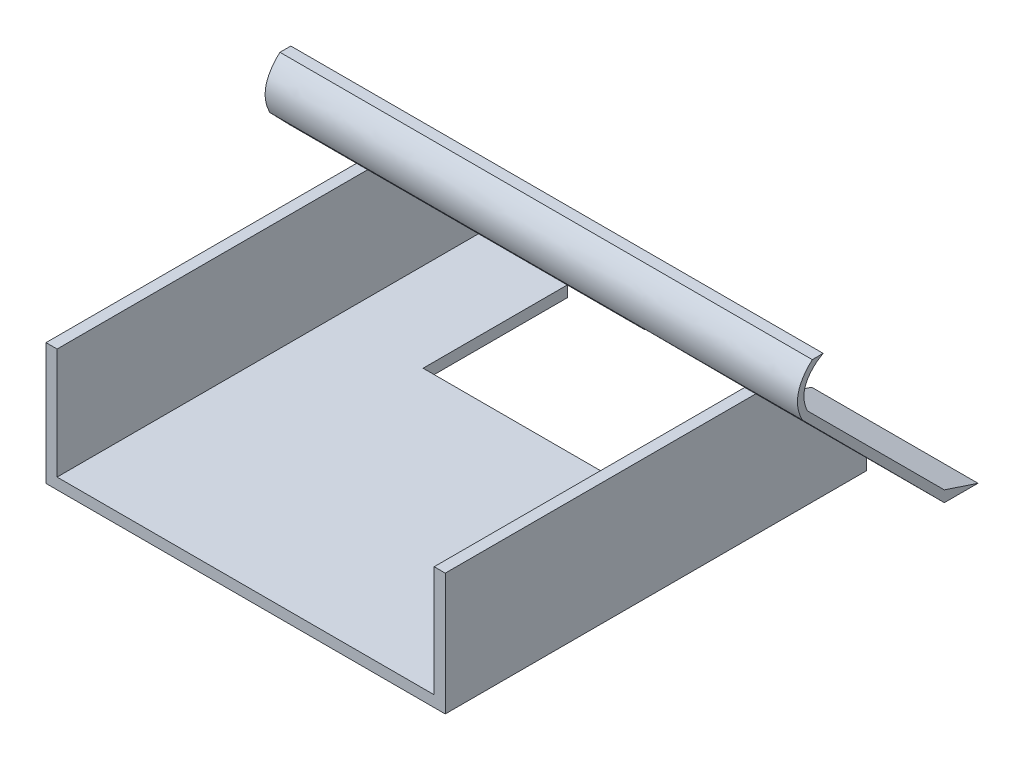
ISO-10303-21;
HEADER;
FILE_DESCRIPTION(('STEP AP214'),'2;1');
FILE_NAME('part.step','',(''),(''),'','','');
FILE_SCHEMA(('AUTOMOTIVE_DESIGN { 1 0 10303 214 1 1 1 1 }'));
ENDSEC;
DATA;
#1=APPLICATION_CONTEXT('core data for automotive mechanical design processes');
#2=APPLICATION_PROTOCOL_DEFINITION('international standard','automotive_design',2000,#1);
#3=PRODUCT_CONTEXT('',#1,'mechanical');
#4=PRODUCT('Part','Part','',(#3));
#5=PRODUCT_RELATED_PRODUCT_CATEGORY('part','',(#4));
#6=PRODUCT_DEFINITION_FORMATION('','',#4);
#7=PRODUCT_DEFINITION_CONTEXT('part definition',#1,'design');
#8=PRODUCT_DEFINITION('design','',#6,#7);
#9=PRODUCT_DEFINITION_SHAPE('','',#8);
#10=(LENGTH_UNIT() NAMED_UNIT(*) SI_UNIT(.MILLI.,.METRE.));
#11=(NAMED_UNIT(*) PLANE_ANGLE_UNIT() SI_UNIT($,.RADIAN.));
#12=(NAMED_UNIT(*) SI_UNIT($,.STERADIAN.) SOLID_ANGLE_UNIT());
#13=UNCERTAINTY_MEASURE_WITH_UNIT(LENGTH_MEASURE(1.E-05),#10,'distance_accuracy_value','');
#14=(GEOMETRIC_REPRESENTATION_CONTEXT(3) GLOBAL_UNCERTAINTY_ASSIGNED_CONTEXT((#13)) GLOBAL_UNIT_ASSIGNED_CONTEXT((#10,
#11,#12)) REPRESENTATION_CONTEXT('',''));
#15=CARTESIAN_POINT('',(0.,0.,0.));
#16=DIRECTION('',(0.,0.,1.));
#17=DIRECTION('',(1.,0.,0.));
#18=AXIS2_PLACEMENT_3D('',#15,#16,#17);
#19=CARTESIAN_POINT('',(45.,0.,0.));
#20=DIRECTION('',(-1.,0.,0.));
#21=DIRECTION('',(0.,0.,1.));
#22=AXIS2_PLACEMENT_3D('',#19,#20,#21);
#23=PLANE('',#22);
#24=DIRECTION('',(0.,-0.708681800429016,-0.705528245884379));
#25=VECTOR('',#24,1.);
#26=CARTESIAN_POINT('',(45.,0.,-100.));
#27=LINE('',#26,#25);
#28=CARTESIAN_POINT('',(45.,64.353430525771,-35.9329350238658));
#29=VERTEX_POINT('',#28);
#30=CARTESIAN_POINT('',(45.,60.,-40.2669932719644));
#31=VERTEX_POINT('',#30);
#32=EDGE_CURVE('E286',#29,#31,#27,.T.);
#33=ORIENTED_EDGE('',*,*,#32,.F.);
#34=DIRECTION('',(0.,-0.730731737442361,-0.682664725831406));
#35=VECTOR('',#34,1.);
#36=CARTESIAN_POINT('',(45.,60.,-40.));
#37=LINE('',#36,#35);
#38=CARTESIAN_POINT('',(45.,60.,-40.));
#39=VERTEX_POINT('',#38);
#40=EDGE_CURVE('E296',#29,#39,#37,.T.);
#41=ORIENTED_EDGE('',*,*,#40,.T.);
#42=DIRECTION('',(0.,0.,-1.));
#43=VECTOR('',#42,1.);
#44=CARTESIAN_POINT('',(45.,60.,-45.0000000000002));
#45=LINE('',#44,#43);
#46=EDGE_CURVE('E311',#39,#31,#45,.T.);
#47=ORIENTED_EDGE('',*,*,#46,.T.);
#48=EDGE_LOOP('',(#33,#41,#47));
#49=FACE_BOUND('',#48,.T.);
#50=ADVANCED_FACE('F43',(#49),#23,.F.);
#51=CARTESIAN_POINT('',(-45.,0.,0.));
#52=DIRECTION('',(-1.,0.,0.));
#53=DIRECTION('',(0.,0.,1.));
#54=AXIS2_PLACEMENT_3D('',#51,#52,#53);
#55=PLANE('',#54);
#56=DIRECTION('',(0.,0.,-1.));
#57=VECTOR('',#56,1.);
#58=CARTESIAN_POINT('',(-45.,60.,-45.0000000000002));
#59=LINE('',#58,#57);
#60=CARTESIAN_POINT('',(-45.,60.,-40.153080492151));
#61=VERTEX_POINT('',#60);
#62=CARTESIAN_POINT('',(-45.,60.,-45.0000000000002));
#63=VERTEX_POINT('',#62);
#64=EDGE_CURVE('E12',#61,#63,#59,.T.);
#65=ORIENTED_EDGE('',*,*,#64,.F.);
#66=DIRECTION('',(0.,0.718012724361384,0.69602997611823));
#67=VECTOR('',#66,1.);
#68=CARTESIAN_POINT('',(-45.,64.353430525771,-35.9329350238658));
#69=LINE('',#68,#67);
#70=CARTESIAN_POINT('',(-45.,55.,-45.0000000000002));
#71=VERTEX_POINT('',#70);
#72=EDGE_CURVE('E321',#71,#61,#69,.T.);
#73=ORIENTED_EDGE('',*,*,#72,.F.);
#74=DIRECTION('',(0.,0.707106781186549,0.707106781186546));
#75=VECTOR('',#74,1.);
#76=CARTESIAN_POINT('',(-45.,55.,-45.0000000000002));
#77=LINE('',#76,#75);
#78=CARTESIAN_POINT('',(-45.,0.,-100.));
#79=VERTEX_POINT('',#78);
#80=EDGE_CURVE('E388',#79,#71,#77,.T.);
#81=ORIENTED_EDGE('',*,*,#80,.F.);
#82=DIRECTION('',(0.,0.,1.));
#83=VECTOR('',#82,1.);
#84=CARTESIAN_POINT('',(-45.,0.,-100.));
#85=LINE('',#84,#83);
#86=CARTESIAN_POINT('',(-45.,0.,-115.179593987314));
#87=VERTEX_POINT('',#86);
#88=EDGE_CURVE('E408',#87,#79,#85,.T.);
#89=ORIENTED_EDGE('',*,*,#88,.F.);
#90=DIRECTION('',(0.,-0.31285456148725,-0.94980104409114));
#91=VECTOR('',#90,1.);
#92=CARTESIAN_POINT('',(-45.,0.,-115.179593987314));
#93=LINE('',#92,#91);
#94=CARTESIAN_POINT('',(-45.,5.,-100.));
#95=VERTEX_POINT('',#94);
#96=EDGE_CURVE('E410',#95,#87,#93,.T.);
#97=ORIENTED_EDGE('',*,*,#96,.F.);
#98=DIRECTION('',(0.,-0.707106781186549,-0.707106781186546));
#99=VECTOR('',#98,1.);
#100=CARTESIAN_POINT('',(-45.,5.,-100.));
#101=LINE('',#100,#99);
#102=EDGE_CURVE('E324',#63,#95,#101,.T.);
#103=ORIENTED_EDGE('',*,*,#102,.F.);
#104=EDGE_LOOP('',(#65,#73,#81,#89,#97,#103));
#105=FACE_BOUND('',#104,.T.);
#106=ADVANCED_FACE('F224',(#105),#55,.F.);
#107=CARTESIAN_POINT('',(-120.,64.353430525771,-35.9329350238658));
#108=DIRECTION('',(0.,0.69602997611823,-0.718012724361384));
#109=DIRECTION('',(0.,0.718012724361384,0.69602997611823));
#110=AXIS2_PLACEMENT_3D('',#107,#108,#109);
#111=PLANE('',#110);
#112=DIRECTION('',(1.,0.,0.));
#113=VECTOR('',#112,1.);
#114=CARTESIAN_POINT('',(-120.,55.,-45.0000000000002));
#115=LINE('',#114,#113);
#116=CARTESIAN_POINT('',(-120.,55.,-45.0000000000002));
#117=VERTEX_POINT('',#116);
#118=EDGE_CURVE('E398',#117,#71,#115,.T.);
#119=ORIENTED_EDGE('',*,*,#118,.T.);
#120=ORIENTED_EDGE('',*,*,#72,.T.);
#121=CARTESIAN_POINT('',(-45.,64.353430525771,-35.9329350238658));
#122=VERTEX_POINT('',#121);
#123=EDGE_CURVE('E325',#61,#122,#69,.T.);
#124=ORIENTED_EDGE('',*,*,#123,.T.);
#125=DIRECTION('',(1.,0.,0.));
#126=VECTOR('',#125,1.);
#127=CARTESIAN_POINT('',(-120.,64.353430525771,-35.9329350238658));
#128=LINE('',#127,#126);
#129=CARTESIAN_POINT('',(-120.,64.353430525771,-35.9329350238658));
#130=VERTEX_POINT('',#129);
#131=EDGE_CURVE('E52',#130,#122,#128,.T.);
#132=ORIENTED_EDGE('',*,*,#131,.F.);
#133=DIRECTION('',(0.,0.718012724361384,0.69602997611823));
#134=VECTOR('',#133,1.);
#135=CARTESIAN_POINT('',(-120.,64.353430525771,-35.9329350238658));
#136=LINE('',#135,#134);
#137=EDGE_CURVE('E387',#117,#130,#136,.T.);
#138=ORIENTED_EDGE('',*,*,#137,.F.);
#139=EDGE_LOOP('',(#119,#120,#124,#132,#138));
#140=FACE_BOUND('',#139,.T.);
#141=ADVANCED_FACE('F45',(#140),#111,.F.);
#142=CARTESIAN_POINT('',(-120.,5.,-100.));
#143=DIRECTION('',(0.,-0.707106781186546,0.707106781186549));
#144=DIRECTION('',(0.,-0.707106781186549,-0.707106781186546));
#145=AXIS2_PLACEMENT_3D('',#142,#143,#144);
#146=PLANE('',#145);
#147=DIRECTION('',(1.,0.,0.));
#148=VECTOR('',#147,1.);
#149=CARTESIAN_POINT('',(-120.,66.7102477509527,-38.2897522490475));
#150=LINE('',#149,#148);
#151=CARTESIAN_POINT('',(-120.,66.7102477509527,-38.2897522490475));
#152=VERTEX_POINT('',#151);
#153=CARTESIAN_POINT('',(120.,66.7102477509527,-38.2897522490475));
#154=VERTEX_POINT('',#153);
#155=EDGE_CURVE('E263',#152,#154,#150,.T.);
#156=ORIENTED_EDGE('',*,*,#155,.T.);
#157=DIRECTION('',(0.,0.707106781186549,0.707106781186546));
#158=VECTOR('',#157,1.);
#159=CARTESIAN_POINT('',(120.,66.7102477509527,-38.2897522490475));
#160=LINE('',#159,#158);
#161=CARTESIAN_POINT('',(120.,5.,-100.));
#162=VERTEX_POINT('',#161);
#163=EDGE_CURVE('E265',#162,#154,#160,.T.);
#164=ORIENTED_EDGE('',*,*,#163,.F.);
#165=DIRECTION('',(-1.,0.,0.));
#166=VECTOR('',#165,1.);
#167=CARTESIAN_POINT('',(120.,5.,-100.));
#168=LINE('',#167,#166);
#169=CARTESIAN_POINT('',(45.,5.,-100.));
#170=VERTEX_POINT('',#169);
#171=EDGE_CURVE('E275',#162,#170,#168,.T.);
#172=ORIENTED_EDGE('',*,*,#171,.T.);
#173=DIRECTION('',(0.,0.707106781186549,0.707106781186546));
#174=VECTOR('',#173,1.);
#175=CARTESIAN_POINT('',(45.,66.7102477509527,-38.2897522490475));
#176=LINE('',#175,#174);
#177=CARTESIAN_POINT('',(45.,60.,-45.0000000000002));
#178=VERTEX_POINT('',#177);
#179=EDGE_CURVE('E349',#170,#178,#176,.T.);
#180=ORIENTED_EDGE('',*,*,#179,.T.);
#181=DIRECTION('',(-1.,0.,0.));
#182=VECTOR('',#181,1.);
#183=CARTESIAN_POINT('',(45.,60.,-45.0000000000002));
#184=LINE('',#183,#182);
#185=EDGE_CURVE('E312',#178,#63,#184,.T.);
#186=ORIENTED_EDGE('',*,*,#185,.T.);
#187=ORIENTED_EDGE('',*,*,#102,.T.);
#188=DIRECTION('',(1.,0.,0.));
#189=VECTOR('',#188,1.);
#190=CARTESIAN_POINT('',(-120.,5.,-100.));
#191=LINE('',#190,#189);
#192=CARTESIAN_POINT('',(-120.,5.,-100.));
#193=VERTEX_POINT('',#192);
#194=EDGE_CURVE('E270',#193,#95,#191,.T.);
#195=ORIENTED_EDGE('',*,*,#194,.F.);
#196=DIRECTION('',(0.,-0.707106781186549,-0.707106781186546));
#197=VECTOR('',#196,1.);
#198=CARTESIAN_POINT('',(-120.,5.,-100.));
#199=LINE('',#198,#197);
#200=EDGE_CURVE('E267',#152,#193,#199,.T.);
#201=ORIENTED_EDGE('',*,*,#200,.F.);
#202=EDGE_LOOP('',(#156,#164,#172,#180,#186,#187,#195,#201));
#203=FACE_BOUND('',#202,.T.);
#204=ADVANCED_FACE('F252',(#203),#146,.F.);
#205=CARTESIAN_POINT('',(-120.,0.,-115.179593987314));
#206=DIRECTION('',(0.,-0.94980104409114,0.31285456148725));
#207=DIRECTION('',(0.,-0.31285456148725,-0.94980104409114));
#208=AXIS2_PLACEMENT_3D('',#205,#206,#207);
#209=PLANE('',#208);
#210=ORIENTED_EDGE('',*,*,#194,.T.);
#211=ORIENTED_EDGE('',*,*,#96,.T.);
#212=DIRECTION('',(1.,0.,0.));
#213=VECTOR('',#212,1.);
#214=CARTESIAN_POINT('',(-120.,0.,-115.179593987314));
#215=LINE('',#214,#213);
#216=CARTESIAN_POINT('',(-120.,0.,-115.179593987314));
#217=VERTEX_POINT('',#216);
#218=EDGE_CURVE('E394',#217,#87,#215,.T.);
#219=ORIENTED_EDGE('',*,*,#218,.F.);
#220=DIRECTION('',(0.,-0.31285456148725,-0.94980104409114));
#221=VECTOR('',#220,1.);
#222=CARTESIAN_POINT('',(-120.,0.,-115.179593987314));
#223=LINE('',#222,#221);
#224=EDGE_CURVE('E403',#193,#217,#223,.T.);
#225=ORIENTED_EDGE('',*,*,#224,.F.);
#226=EDGE_LOOP('',(#210,#211,#219,#225));
#227=FACE_BOUND('',#226,.T.);
#228=ADVANCED_FACE('F249',(#227),#209,.F.);
#229=CARTESIAN_POINT('',(-120.,0.,-100.));
#230=DIRECTION('',(0.,1.,0.));
#231=DIRECTION('',(0.,0.,1.));
#232=AXIS2_PLACEMENT_3D('',#229,#230,#231);
#233=PLANE('',#232);
#234=ORIENTED_EDGE('',*,*,#218,.T.);
#235=ORIENTED_EDGE('',*,*,#88,.T.);
#236=DIRECTION('',(1.,0.,0.));
#237=VECTOR('',#236,1.);
#238=CARTESIAN_POINT('',(-120.,0.,-100.));
#239=LINE('',#238,#237);
#240=CARTESIAN_POINT('',(-120.,0.,-100.));
#241=VERTEX_POINT('',#240);
#242=EDGE_CURVE('E396',#241,#79,#239,.T.);
#243=ORIENTED_EDGE('',*,*,#242,.F.);
#244=DIRECTION('',(0.,0.,1.));
#245=VECTOR('',#244,1.);
#246=CARTESIAN_POINT('',(-120.,0.,-100.));
#247=LINE('',#246,#245);
#248=EDGE_CURVE('E401',#217,#241,#247,.T.);
#249=ORIENTED_EDGE('',*,*,#248,.F.);
#250=EDGE_LOOP('',(#234,#235,#243,#249));
#251=FACE_BOUND('',#250,.T.);
#252=ADVANCED_FACE('F245',(#251),#233,.F.);
#253=CARTESIAN_POINT('',(-120.,55.,-45.0000000000002));
#254=DIRECTION('',(0.,0.707106781186546,-0.707106781186549));
#255=DIRECTION('',(0.,0.707106781186549,0.707106781186546));
#256=AXIS2_PLACEMENT_3D('',#253,#254,#255);
#257=PLANE('',#256);
#258=ORIENTED_EDGE('',*,*,#242,.T.);
#259=ORIENTED_EDGE('',*,*,#80,.T.);
#260=ORIENTED_EDGE('',*,*,#118,.F.);
#261=DIRECTION('',(0.,0.707106781186549,0.707106781186546));
#262=VECTOR('',#261,1.);
#263=CARTESIAN_POINT('',(-120.,55.,-45.0000000000002));
#264=LINE('',#263,#262);
#265=EDGE_CURVE('E67',#241,#117,#264,.T.);
#266=ORIENTED_EDGE('',*,*,#265,.F.);
#267=EDGE_LOOP('',(#258,#259,#260,#266));
#268=FACE_BOUND('',#267,.T.);
#269=ADVANCED_FACE('F242',(#268),#257,.F.);
#270=CARTESIAN_POINT('',(-120.,0.,0.));
#271=DIRECTION('',(-1.,0.,0.));
#272=DIRECTION('',(0.,0.,1.));
#273=AXIS2_PLACEMENT_3D('',#270,#271,#272);
#274=PLANE('',#273);
#275=ORIENTED_EDGE('',*,*,#137,.T.);
#276=CARTESIAN_POINT('',(-120.,64.353430525771,-35.9329350238658));
#277=CARTESIAN_POINT('',(-120.,76.0268249741707,-29.9996183368631));
#278=CARTESIAN_POINT('',(-120.,85.6244735808665,-40.4707945091157));
#279=B_SPLINE_CURVE_WITH_KNOTS('',2,(#276,#277,#278),.UNSPECIFIED.,.F.,.F.,(3,3),(0.,1.),.UNSPECIFIED.);
#280=CARTESIAN_POINT('',(-120.,85.6244735808665,-40.4707945091157));
#281=VERTEX_POINT('',#280);
#282=EDGE_CURVE('E364',#130,#281,#279,.T.);
#283=ORIENTED_EDGE('',*,*,#282,.T.);
#284=DIRECTION('',(0.,0.,-1.));
#285=VECTOR('',#284,1.);
#286=CARTESIAN_POINT('',(-120.,85.6244735808665,-40.4707945091157));
#287=LINE('',#286,#285);
#288=CARTESIAN_POINT('',(-120.,85.6244735808665,-45.3688095403349));
#289=VERTEX_POINT('',#288);
#290=EDGE_CURVE('E164',#281,#289,#287,.T.);
#291=ORIENTED_EDGE('',*,*,#290,.T.);
#292=DIRECTION('',(0.,-0.536875492193158,0.843661487732109));
#293=VECTOR('',#292,1.);
#294=CARTESIAN_POINT('',(-120.,85.6244735808665,-45.3688095403349));
#295=LINE('',#294,#293);
#296=CARTESIAN_POINT('',(-120.,83.851054345425,-42.5820078846412));
#297=VERTEX_POINT('',#296);
#298=EDGE_CURVE('E188',#289,#297,#295,.T.);
#299=ORIENTED_EDGE('',*,*,#298,.T.);
#300=CARTESIAN_POINT('',(-120.,83.851054345425,-42.5820078846412));
#301=CARTESIAN_POINT('',(-120.,76.5046634323354,-33.6123210873994));
#302=CARTESIAN_POINT('',(-120.,66.7102477509527,-38.2897522490475));
#303=B_SPLINE_CURVE_WITH_KNOTS('',2,(#300,#301,#302),.UNSPECIFIED.,.F.,.F.,(3,3),(0.,1.),.UNSPECIFIED.);
#304=EDGE_CURVE('E185',#297,#152,#303,.T.);
#305=ORIENTED_EDGE('',*,*,#304,.T.);
#306=ORIENTED_EDGE('',*,*,#200,.T.);
#307=ORIENTED_EDGE('',*,*,#224,.T.);
#308=ORIENTED_EDGE('',*,*,#248,.T.);
#309=ORIENTED_EDGE('',*,*,#265,.T.);
#310=EDGE_LOOP('',(#275,#283,#291,#299,#305,#306,#307,#308,#309));
#311=FACE_BOUND('',#310,.T.);
#312=ADVANCED_FACE('F230',(#311),#274,.T.);
#313=CARTESIAN_POINT('',(-45.,0.,0.));
#314=DIRECTION('',(-1.,0.,0.));
#315=DIRECTION('',(0.,0.,1.));
#316=AXIS2_PLACEMENT_3D('',#313,#314,#315);
#317=PLANE('',#316);
#318=ORIENTED_EDGE('',*,*,#123,.F.);
#319=CARTESIAN_POINT('',(-45.,60.,-40.));
#320=VERTEX_POINT('',#319);
#321=EDGE_CURVE('E54',#320,#61,#59,.T.);
#322=ORIENTED_EDGE('',*,*,#321,.F.);
#323=DIRECTION('',(0.,-0.730731737442361,-0.682664725831406));
#324=VECTOR('',#323,1.);
#325=CARTESIAN_POINT('',(-45.,60.,-40.));
#326=LINE('',#325,#324);
#327=EDGE_CURVE('E300',#122,#320,#326,.T.);
#328=ORIENTED_EDGE('',*,*,#327,.F.);
#329=EDGE_LOOP('',(#318,#322,#328));
#330=FACE_BOUND('',#329,.T.);
#331=ADVANCED_FACE('F226',(#330),#317,.T.);
#332=CARTESIAN_POINT('',(45.,60.,-40.));
#333=DIRECTION('',(0.,0.682664725831406,-0.730731737442361));
#334=DIRECTION('',(0.,0.730731737442361,0.682664725831406));
#335=AXIS2_PLACEMENT_3D('',#332,#333,#334);
#336=PLANE('',#335);
#337=ORIENTED_EDGE('',*,*,#327,.T.);
#338=DIRECTION('',(-1.,0.,0.));
#339=VECTOR('',#338,1.);
#340=CARTESIAN_POINT('',(45.,60.,-40.));
#341=LINE('',#340,#339);
#342=EDGE_CURVE('E317',#39,#320,#341,.T.);
#343=ORIENTED_EDGE('',*,*,#342,.F.);
#344=ORIENTED_EDGE('',*,*,#40,.F.);
#345=DIRECTION('',(-1.,0.,0.));
#346=VECTOR('',#345,1.);
#347=CARTESIAN_POINT('',(45.,64.353430525771,-35.9329350238658));
#348=LINE('',#347,#346);
#349=EDGE_CURVE('E320',#29,#122,#348,.T.);
#350=ORIENTED_EDGE('',*,*,#349,.T.);
#351=EDGE_LOOP('',(#337,#343,#344,#350));
#352=FACE_BOUND('',#351,.T.);
#353=ADVANCED_FACE('F229',(#352),#336,.F.);
#354=CARTESIAN_POINT('',(45.,60.,-45.0000000000002));
#355=DIRECTION('',(0.,1.,0.));
#356=DIRECTION('',(0.,0.,1.));
#357=AXIS2_PLACEMENT_3D('',#354,#355,#356);
#358=PLANE('',#357);
#359=ORIENTED_EDGE('',*,*,#321,.T.);
#360=ORIENTED_EDGE('',*,*,#64,.T.);
#361=ORIENTED_EDGE('',*,*,#185,.F.);
#362=EDGE_CURVE('E298',#31,#178,#45,.T.);
#363=ORIENTED_EDGE('',*,*,#362,.F.);
#364=ORIENTED_EDGE('',*,*,#46,.F.);
#365=ORIENTED_EDGE('',*,*,#342,.T.);
#366=EDGE_LOOP('',(#359,#360,#361,#363,#364,#365));
#367=FACE_BOUND('',#366,.T.);
#368=ADVANCED_FACE('F220',(#367),#358,.F.);
#369=CARTESIAN_POINT('',(120.,0.,-100.));
#370=DIRECTION('',(0.,0.705528245884379,-0.708681800429016));
#371=DIRECTION('',(0.,0.708681800429016,0.705528245884379));
#372=AXIS2_PLACEMENT_3D('',#369,#370,#371);
#373=PLANE('',#372);
#374=ORIENTED_EDGE('',*,*,#32,.T.);
#375=CARTESIAN_POINT('',(45.,0.,-100.));
#376=VERTEX_POINT('',#375);
#377=EDGE_CURVE('E283',#31,#376,#27,.T.);
#378=ORIENTED_EDGE('',*,*,#377,.T.);
#379=DIRECTION('',(-1.,0.,0.));
#380=VECTOR('',#379,1.);
#381=CARTESIAN_POINT('',(120.,0.,-100.));
#382=LINE('',#381,#380);
#383=CARTESIAN_POINT('',(120.,0.,-100.));
#384=VERTEX_POINT('',#383);
#385=EDGE_CURVE('E301',#384,#376,#382,.T.);
#386=ORIENTED_EDGE('',*,*,#385,.F.);
#387=DIRECTION('',(0.,-0.708681800429016,-0.705528245884379));
#388=VECTOR('',#387,1.);
#389=CARTESIAN_POINT('',(120.,0.,-100.));
#390=LINE('',#389,#388);
#391=CARTESIAN_POINT('',(120.,64.353430525771,-35.9329350238658));
#392=VERTEX_POINT('',#391);
#393=EDGE_CURVE('E350',#392,#384,#390,.T.);
#394=ORIENTED_EDGE('',*,*,#393,.F.);
#395=DIRECTION('',(-1.,0.,0.));
#396=VECTOR('',#395,1.);
#397=CARTESIAN_POINT('',(120.,64.353430525771,-35.9329350238658));
#398=LINE('',#397,#396);
#399=EDGE_CURVE('E183',#392,#29,#398,.T.);
#400=ORIENTED_EDGE('',*,*,#399,.T.);
#401=EDGE_LOOP('',(#374,#378,#386,#394,#400));
#402=FACE_BOUND('',#401,.T.);
#403=ADVANCED_FACE('F216',(#402),#373,.F.);
#404=CARTESIAN_POINT('',(120.,0.,-115.179593987314));
#405=DIRECTION('',(0.,1.,0.));
#406=DIRECTION('',(0.,0.,1.));
#407=AXIS2_PLACEMENT_3D('',#404,#405,#406);
#408=PLANE('',#407);
#409=DIRECTION('',(0.,0.,-1.));
#410=VECTOR('',#409,1.);
#411=CARTESIAN_POINT('',(45.,0.,-115.179593987314));
#412=LINE('',#411,#410);
#413=CARTESIAN_POINT('',(45.,0.,-115.179593987314));
#414=VERTEX_POINT('',#413);
#415=EDGE_CURVE('E288',#376,#414,#412,.T.);
#416=ORIENTED_EDGE('',*,*,#415,.T.);
#417=DIRECTION('',(-1.,0.,0.));
#418=VECTOR('',#417,1.);
#419=CARTESIAN_POINT('',(120.,0.,-115.179593987314));
#420=LINE('',#419,#418);
#421=CARTESIAN_POINT('',(120.,0.,-115.179593987314));
#422=VERTEX_POINT('',#421);
#423=EDGE_CURVE('E277',#422,#414,#420,.T.);
#424=ORIENTED_EDGE('',*,*,#423,.F.);
#425=DIRECTION('',(0.,0.,-1.));
#426=VECTOR('',#425,1.);
#427=CARTESIAN_POINT('',(120.,0.,-115.179593987314));
#428=LINE('',#427,#426);
#429=EDGE_CURVE('E279',#384,#422,#428,.T.);
#430=ORIENTED_EDGE('',*,*,#429,.F.);
#431=ORIENTED_EDGE('',*,*,#385,.T.);
#432=EDGE_LOOP('',(#416,#424,#430,#431));
#433=FACE_BOUND('',#432,.T.);
#434=ADVANCED_FACE('F212',(#433),#408,.F.);
#435=CARTESIAN_POINT('',(120.,5.,-100.));
#436=DIRECTION('',(0.,-0.94980104409114,0.31285456148725));
#437=DIRECTION('',(0.,-0.31285456148725,-0.949801044091141));
#438=AXIS2_PLACEMENT_3D('',#435,#436,#437);
#439=PLANE('',#438);
#440=DIRECTION('',(0.,0.31285456148725,0.94980104409114));
#441=VECTOR('',#440,1.);
#442=CARTESIAN_POINT('',(45.,5.,-100.));
#443=LINE('',#442,#441);
#444=EDGE_CURVE('E347',#414,#170,#443,.T.);
#445=ORIENTED_EDGE('',*,*,#444,.T.);
#446=ORIENTED_EDGE('',*,*,#171,.F.);
#447=DIRECTION('',(0.,0.31285456148725,0.94980104409114));
#448=VECTOR('',#447,1.);
#449=CARTESIAN_POINT('',(120.,5.,-100.));
#450=LINE('',#449,#448);
#451=EDGE_CURVE('E273',#422,#162,#450,.T.);
#452=ORIENTED_EDGE('',*,*,#451,.F.);
#453=ORIENTED_EDGE('',*,*,#423,.T.);
#454=EDGE_LOOP('',(#445,#446,#452,#453));
#455=FACE_BOUND('',#454,.T.);
#456=ADVANCED_FACE('F206',(#455),#439,.F.);
#457=CARTESIAN_POINT('',(120.,0.,0.));
#458=DIRECTION('',(-1.,0.,0.));
#459=DIRECTION('',(0.,0.,1.));
#460=AXIS2_PLACEMENT_3D('',#457,#458,#459);
#461=PLANE('',#460);
#462=ORIENTED_EDGE('',*,*,#163,.T.);
#463=CARTESIAN_POINT('',(120.,83.851054345425,-42.5820078846412));
#464=CARTESIAN_POINT('',(120.,76.5046634323354,-33.6123210873994));
#465=CARTESIAN_POINT('',(120.,66.7102477509527,-38.2897522490475));
#466=B_SPLINE_CURVE_WITH_KNOTS('',2,(#463,#464,#465),.UNSPECIFIED.,.F.,.F.,(3,3),(0.,1.),.UNSPECIFIED.);
#467=CARTESIAN_POINT('',(120.,83.851054345425,-42.5820078846412));
#468=VERTEX_POINT('',#467);
#469=EDGE_CURVE('E169',#468,#154,#466,.T.);
#470=ORIENTED_EDGE('',*,*,#469,.F.);
#471=DIRECTION('',(0.,-0.536875492193158,0.843661487732109));
#472=VECTOR('',#471,1.);
#473=CARTESIAN_POINT('',(120.,85.6244735808665,-45.3688095403349));
#474=LINE('',#473,#472);
#475=CARTESIAN_POINT('',(120.,85.6244735808665,-45.3688095403349));
#476=VERTEX_POINT('',#475);
#477=EDGE_CURVE('E179',#476,#468,#474,.T.);
#478=ORIENTED_EDGE('',*,*,#477,.F.);
#479=DIRECTION('',(0.,0.,-1.));
#480=VECTOR('',#479,1.);
#481=CARTESIAN_POINT('',(120.,85.6244735808665,-40.4707945091157));
#482=LINE('',#481,#480);
#483=CARTESIAN_POINT('',(120.,85.6244735808665,-40.4707945091157));
#484=VERTEX_POINT('',#483);
#485=EDGE_CURVE('E162',#484,#476,#482,.T.);
#486=ORIENTED_EDGE('',*,*,#485,.F.);
#487=CARTESIAN_POINT('',(120.,64.353430525771,-35.9329350238658));
#488=CARTESIAN_POINT('',(120.,76.0268249741707,-29.9996183368631));
#489=CARTESIAN_POINT('',(120.,85.6244735808665,-40.4707945091157));
#490=B_SPLINE_CURVE_WITH_KNOTS('',2,(#487,#488,#489),.UNSPECIFIED.,.F.,.F.,(3,3),(0.,1.),.UNSPECIFIED.);
#491=EDGE_CURVE('E175',#392,#484,#490,.T.);
#492=ORIENTED_EDGE('',*,*,#491,.F.);
#493=ORIENTED_EDGE('',*,*,#393,.T.);
#494=ORIENTED_EDGE('',*,*,#429,.T.);
#495=ORIENTED_EDGE('',*,*,#451,.T.);
#496=EDGE_LOOP('',(#462,#470,#478,#486,#492,#493,#494,#495));
#497=FACE_BOUND('',#496,.T.);
#498=ADVANCED_FACE('F174',(#497),#461,.F.);
#499=CARTESIAN_POINT('',(45.,0.,0.));
#500=DIRECTION('',(-1.,0.,0.));
#501=DIRECTION('',(0.,0.,1.));
#502=AXIS2_PLACEMENT_3D('',#499,#500,#501);
#503=PLANE('',#502);
#504=ORIENTED_EDGE('',*,*,#377,.F.);
#505=ORIENTED_EDGE('',*,*,#362,.T.);
#506=ORIENTED_EDGE('',*,*,#179,.F.);
#507=ORIENTED_EDGE('',*,*,#444,.F.);
#508=ORIENTED_EDGE('',*,*,#415,.F.);
#509=EDGE_LOOP('',(#504,#505,#506,#507,#508));
#510=FACE_BOUND('',#509,.T.);
#511=ADVANCED_FACE('F202',(#510),#503,.T.);
#512=DIRECTION('',(-1.,0.,0.));
#513=VECTOR('',#512,1.);
#514=SURFACE_OF_LINEAR_EXTRUSION('',#490,#513);
#515=ORIENTED_EDGE('',*,*,#282,.F.);
#516=ORIENTED_EDGE('',*,*,#131,.T.);
#517=ORIENTED_EDGE('',*,*,#349,.F.);
#518=ORIENTED_EDGE('',*,*,#399,.F.);
#519=ORIENTED_EDGE('',*,*,#491,.T.);
#520=DIRECTION('',(-1.,0.,0.));
#521=VECTOR('',#520,1.);
#522=CARTESIAN_POINT('',(120.,85.6244735808665,-40.4707945091157));
#523=LINE('',#522,#521);
#524=EDGE_CURVE('E159',#484,#281,#523,.T.);
#525=ORIENTED_EDGE('',*,*,#524,.T.);
#526=EDGE_LOOP('',(#515,#516,#517,#518,#519,#525));
#527=FACE_BOUND('',#526,.T.);
#528=ADVANCED_FACE('F181',(#527),#514,.T.);
#529=DIRECTION('',(-1.,0.,0.));
#530=VECTOR('',#529,1.);
#531=SURFACE_OF_LINEAR_EXTRUSION('',#466,#530);
#532=ORIENTED_EDGE('',*,*,#304,.F.);
#533=DIRECTION('',(-1.,0.,0.));
#534=VECTOR('',#533,1.);
#535=CARTESIAN_POINT('',(120.,83.851054345425,-42.5820078846412));
#536=LINE('',#535,#534);
#537=EDGE_CURVE('E287',#468,#297,#536,.T.);
#538=ORIENTED_EDGE('',*,*,#537,.F.);
#539=ORIENTED_EDGE('',*,*,#469,.T.);
#540=ORIENTED_EDGE('',*,*,#155,.F.);
#541=EDGE_LOOP('',(#532,#538,#539,#540));
#542=FACE_BOUND('',#541,.T.);
#543=ADVANCED_FACE('F201',(#542),#531,.T.);
#544=CARTESIAN_POINT('',(120.,85.6244735808665,-45.3688095403349));
#545=DIRECTION('',(0.,-0.843661487732108,-0.536875492193158));
#546=DIRECTION('',(0.,0.536875492193158,-0.843661487732109));
#547=AXIS2_PLACEMENT_3D('',#544,#545,#546);
#548=PLANE('',#547);
#549=ORIENTED_EDGE('',*,*,#298,.F.);
#550=DIRECTION('',(-1.,0.,0.));
#551=VECTOR('',#550,1.);
#552=CARTESIAN_POINT('',(120.,85.6244735808665,-45.3688095403349));
#553=LINE('',#552,#551);
#554=EDGE_CURVE('E168',#476,#289,#553,.T.);
#555=ORIENTED_EDGE('',*,*,#554,.F.);
#556=ORIENTED_EDGE('',*,*,#477,.T.);
#557=ORIENTED_EDGE('',*,*,#537,.T.);
#558=EDGE_LOOP('',(#549,#555,#556,#557));
#559=FACE_BOUND('',#558,.T.);
#560=ADVANCED_FACE('F379',(#559),#548,.T.);
#561=CARTESIAN_POINT('',(120.,85.6244735808665,-40.4707945091157));
#562=DIRECTION('',(0.,1.,0.));
#563=DIRECTION('',(0.,0.,1.));
#564=AXIS2_PLACEMENT_3D('',#561,#562,#563);
#565=PLANE('',#564);
#566=ORIENTED_EDGE('',*,*,#290,.F.);
#567=ORIENTED_EDGE('',*,*,#524,.F.);
#568=ORIENTED_EDGE('',*,*,#485,.T.);
#569=ORIENTED_EDGE('',*,*,#554,.T.);
#570=EDGE_LOOP('',(#566,#567,#568,#569));
#571=FACE_BOUND('',#570,.T.);
#572=ADVANCED_FACE('F161',(#571),#565,.T.);
#573=CLOSED_SHELL('',(#50,#106,#141,#204,#228,#252,#269,#312,#331,#353,#368,#403,#434,#456,#498,
#511,#528,#543,#560,#572));
#574=MANIFOLD_SOLID_BREP('B2',#573);
#575=CARTESIAN_POINT('',(-90.,5.,-95.));
#576=DIRECTION('',(0.,0.,1.));
#577=DIRECTION('',(1.,0.,0.));
#578=AXIS2_PLACEMENT_3D('',#575,#576,#577);
#579=PLANE('',#578);
#580=DIRECTION('',(-1.,0.,0.));
#581=VECTOR('',#580,1.);
#582=CARTESIAN_POINT('',(-90.,5.,-95.));
#583=LINE('',#582,#581);
#584=CARTESIAN_POINT('',(-45.,5.,-95.));
#585=VERTEX_POINT('',#584);
#586=CARTESIAN_POINT('',(-85.,5.,-95.));
#587=VERTEX_POINT('',#586);
#588=EDGE_CURVE('E719',#585,#587,#583,.T.);
#589=ORIENTED_EDGE('',*,*,#588,.F.);
#590=DIRECTION('',(0.,1.,0.));
#591=VECTOR('',#590,1.);
#592=CARTESIAN_POINT('',(-45.,-208.,-95.));
#593=LINE('',#592,#591);
#594=CARTESIAN_POINT('',(-45.,0.,-95.));
#595=VERTEX_POINT('',#594);
#596=EDGE_CURVE('E659',#595,#585,#593,.T.);
#597=ORIENTED_EDGE('',*,*,#596,.F.);
#598=DIRECTION('',(-1.,0.,0.));
#599=VECTOR('',#598,1.);
#600=CARTESIAN_POINT('',(-90.,0.,-95.));
#601=LINE('',#600,#599);
#602=CARTESIAN_POINT('',(-90.,0.,-95.));
#603=VERTEX_POINT('',#602);
#604=EDGE_CURVE('E724',#595,#603,#601,.T.);
#605=ORIENTED_EDGE('',*,*,#604,.T.);
#606=DIRECTION('',(0.,-1.,0.));
#607=VECTOR('',#606,1.);
#608=CARTESIAN_POINT('',(-90.,5.,-95.));
#609=LINE('',#608,#607);
#610=CARTESIAN_POINT('',(-90.,5.,-95.));
#611=VERTEX_POINT('',#610);
#612=EDGE_CURVE('E737',#611,#603,#609,.T.);
#613=ORIENTED_EDGE('',*,*,#612,.F.);
#614=DIRECTION('',(-1.,0.,0.));
#615=VECTOR('',#614,1.);
#616=CARTESIAN_POINT('',(123.,5.,-95.));
#617=LINE('',#616,#615);
#618=EDGE_CURVE('E674',#587,#611,#617,.T.);
#619=ORIENTED_EDGE('',*,*,#618,.F.);
#620=EDGE_LOOP('',(#589,#597,#605,#613,#619));
#621=FACE_BOUND('',#620,.T.);
#622=ADVANCED_FACE('F551',(#621),#579,.F.);
#623=CARTESIAN_POINT('',(0.,5.,0.));
#624=DIRECTION('',(0.,1.,0.));
#625=DIRECTION('',(0.,0.,1.));
#626=AXIS2_PLACEMENT_3D('',#623,#624,#625);
#627=PLANE('',#626);
#628=DIRECTION('',(0.,0.,1.));
#629=VECTOR('',#628,1.);
#630=CARTESIAN_POINT('',(-45.,5.,-95.));
#631=LINE('',#630,#629);
#632=CARTESIAN_POINT('',(-45.,5.,-30.));
#633=VERTEX_POINT('',#632);
#634=EDGE_CURVE('E656',#585,#633,#631,.T.);
#635=ORIENTED_EDGE('',*,*,#634,.F.);
#636=ORIENTED_EDGE('',*,*,#588,.T.);
#637=DIRECTION('',(0.,0.,-1.));
#638=VECTOR('',#637,1.);
#639=CARTESIAN_POINT('',(-85.,5.,-95.));
#640=LINE('',#639,#638);
#641=CARTESIAN_POINT('',(-85.,5.,95.));
#642=VERTEX_POINT('',#641);
#643=EDGE_CURVE('E702',#642,#587,#640,.T.);
#644=ORIENTED_EDGE('',*,*,#643,.F.);
#645=DIRECTION('',(1.,0.,0.));
#646=VECTOR('',#645,1.);
#647=CARTESIAN_POINT('',(-90.,5.,95.));
#648=LINE('',#647,#646);
#649=CARTESIAN_POINT('',(84.9999999999999,5.,95.));
#650=VERTEX_POINT('',#649);
#651=EDGE_CURVE('E718',#642,#650,#648,.T.);
#652=ORIENTED_EDGE('',*,*,#651,.T.);
#653=DIRECTION('',(0.,0.,1.));
#654=VECTOR('',#653,1.);
#655=CARTESIAN_POINT('',(85.,5.,-95.));
#656=LINE('',#655,#654);
#657=CARTESIAN_POINT('',(85.,5.,-95.));
#658=VERTEX_POINT('',#657);
#659=EDGE_CURVE('E688',#658,#650,#656,.T.);
#660=ORIENTED_EDGE('',*,*,#659,.F.);
#661=CARTESIAN_POINT('',(45.,5.,-95.));
#662=VERTEX_POINT('',#661);
#663=EDGE_CURVE('E716',#658,#662,#583,.T.);
#664=ORIENTED_EDGE('',*,*,#663,.T.);
#665=DIRECTION('',(0.,0.,-1.));
#666=VECTOR('',#665,1.);
#667=CARTESIAN_POINT('',(45.,5.,-95.));
#668=LINE('',#667,#666);
#669=CARTESIAN_POINT('',(45.,5.,-30.));
#670=VERTEX_POINT('',#669);
#671=EDGE_CURVE('E653',#670,#662,#668,.T.);
#672=ORIENTED_EDGE('',*,*,#671,.F.);
#673=DIRECTION('',(1.,0.,0.));
#674=VECTOR('',#673,1.);
#675=CARTESIAN_POINT('',(-45.,5.,-30.));
#676=LINE('',#675,#674);
#677=EDGE_CURVE('E648',#633,#670,#676,.T.);
#678=ORIENTED_EDGE('',*,*,#677,.F.);
#679=EDGE_LOOP('',(#635,#636,#644,#652,#660,#664,#672,#678));
#680=FACE_BOUND('',#679,.T.);
#681=ADVANCED_FACE('F663',(#680),#627,.T.);
#682=CARTESIAN_POINT('',(90.,5.,-95.));
#683=DIRECTION('',(-1.,0.,0.));
#684=DIRECTION('',(0.,0.,1.));
#685=AXIS2_PLACEMENT_3D('',#682,#683,#684);
#686=PLANE('',#685);
#687=DIRECTION('',(0.,-1.,0.));
#688=VECTOR('',#687,1.);
#689=CARTESIAN_POINT('',(90.,5.,-95.));
#690=LINE('',#689,#688);
#691=CARTESIAN_POINT('',(90.,5.,-95.));
#692=VERTEX_POINT('',#691);
#693=CARTESIAN_POINT('',(90.,0.,-95.));
#694=VERTEX_POINT('',#693);
#695=EDGE_CURVE('E740',#692,#694,#690,.T.);
#696=ORIENTED_EDGE('',*,*,#695,.F.);
#697=DIRECTION('',(0.,0.707106781186549,0.707106781186546));
#698=VECTOR('',#697,1.);
#699=CARTESIAN_POINT('',(90.,5.,-95.));
#700=LINE('',#699,#698);
#701=CARTESIAN_POINT('',(90.,55.,-45.0000000000002));
#702=VERTEX_POINT('',#701);
#703=EDGE_CURVE('E685',#692,#702,#700,.T.);
#704=ORIENTED_EDGE('',*,*,#703,.T.);
#705=DIRECTION('',(0.,0.,-1.));
#706=VECTOR('',#705,1.);
#707=CARTESIAN_POINT('',(90.,55.,-95.));
#708=LINE('',#707,#706);
#709=CARTESIAN_POINT('',(90.,55.,95.));
#710=VERTEX_POINT('',#709);
#711=EDGE_CURVE('E689',#710,#702,#708,.T.);
#712=ORIENTED_EDGE('',*,*,#711,.F.);
#713=DIRECTION('',(0.,-1.,0.));
#714=VECTOR('',#713,1.);
#715=CARTESIAN_POINT('',(90.,5.,95.));
#716=LINE('',#715,#714);
#717=CARTESIAN_POINT('',(90.,0.,95.));
#718=VERTEX_POINT('',#717);
#719=EDGE_CURVE('E721',#710,#718,#716,.T.);
#720=ORIENTED_EDGE('',*,*,#719,.T.);
#721=DIRECTION('',(0.,0.,-1.));
#722=VECTOR('',#721,1.);
#723=CARTESIAN_POINT('',(90.,0.,-95.));
#724=LINE('',#723,#722);
#725=EDGE_CURVE('E715',#718,#694,#724,.T.);
#726=ORIENTED_EDGE('',*,*,#725,.T.);
#727=EDGE_LOOP('',(#696,#704,#712,#720,#726));
#728=FACE_BOUND('',#727,.T.);
#729=ADVANCED_FACE('F553',(#728),#686,.F.);
#730=CARTESIAN_POINT('',(45.,0.,-95.));
#731=VERTEX_POINT('',#730);
#732=EDGE_CURVE('E725',#694,#731,#601,.T.);
#733=ORIENTED_EDGE('',*,*,#732,.T.);
#734=DIRECTION('',(0.,1.,0.));
#735=VECTOR('',#734,1.);
#736=CARTESIAN_POINT('',(45.,-208.,-95.));
#737=LINE('',#736,#735);
#738=EDGE_CURVE('E669',#731,#662,#737,.T.);
#739=ORIENTED_EDGE('',*,*,#738,.T.);
#740=ORIENTED_EDGE('',*,*,#663,.F.);
#741=EDGE_CURVE('E678',#692,#658,#617,.T.);
#742=ORIENTED_EDGE('',*,*,#741,.F.);
#743=ORIENTED_EDGE('',*,*,#695,.T.);
#744=EDGE_LOOP('',(#733,#739,#740,#742,#743));
#745=FACE_BOUND('',#744,.T.);
#746=ADVANCED_FACE('F753',(#745),#579,.F.);
#747=CARTESIAN_POINT('',(-90.,5.,-95.));
#748=DIRECTION('',(1.,0.,0.));
#749=DIRECTION('',(0.,0.,-1.));
#750=AXIS2_PLACEMENT_3D('',#747,#748,#749);
#751=PLANE('',#750);
#752=DIRECTION('',(0.,0.,1.));
#753=VECTOR('',#752,1.);
#754=CARTESIAN_POINT('',(-90.,55.,-95.));
#755=LINE('',#754,#753);
#756=CARTESIAN_POINT('',(-90.,55.,-45.0000000000002));
#757=VERTEX_POINT('',#756);
#758=CARTESIAN_POINT('',(-90.,55.,95.));
#759=VERTEX_POINT('',#758);
#760=EDGE_CURVE('E703',#757,#759,#755,.T.);
#761=ORIENTED_EDGE('',*,*,#760,.F.);
#762=DIRECTION('',(0.,0.707106781186549,0.707106781186546));
#763=VECTOR('',#762,1.);
#764=CARTESIAN_POINT('',(-90.,5.,-95.));
#765=LINE('',#764,#763);
#766=EDGE_CURVE('E574',#611,#757,#765,.T.);
#767=ORIENTED_EDGE('',*,*,#766,.F.);
#768=ORIENTED_EDGE('',*,*,#612,.T.);
#769=DIRECTION('',(0.,0.,1.));
#770=VECTOR('',#769,1.);
#771=CARTESIAN_POINT('',(-90.,0.,-95.));
#772=LINE('',#771,#770);
#773=CARTESIAN_POINT('',(-90.,0.,95.));
#774=VERTEX_POINT('',#773);
#775=EDGE_CURVE('E728',#603,#774,#772,.T.);
#776=ORIENTED_EDGE('',*,*,#775,.T.);
#777=DIRECTION('',(0.,-1.,0.));
#778=VECTOR('',#777,1.);
#779=CARTESIAN_POINT('',(-90.,5.,95.));
#780=LINE('',#779,#778);
#781=EDGE_CURVE('E734',#759,#774,#780,.T.);
#782=ORIENTED_EDGE('',*,*,#781,.F.);
#783=EDGE_LOOP('',(#761,#767,#768,#776,#782));
#784=FACE_BOUND('',#783,.T.);
#785=ADVANCED_FACE('F769',(#784),#751,.F.);
#786=CARTESIAN_POINT('',(-90.,5.,95.));
#787=DIRECTION('',(0.,0.,-1.));
#788=DIRECTION('',(-1.,0.,0.));
#789=AXIS2_PLACEMENT_3D('',#786,#787,#788);
#790=PLANE('',#789);
#791=DIRECTION('',(1.,0.,0.));
#792=VECTOR('',#791,1.);
#793=CARTESIAN_POINT('',(-90.,0.,95.));
#794=LINE('',#793,#792);
#795=EDGE_CURVE('E730',#774,#718,#794,.T.);
#796=ORIENTED_EDGE('',*,*,#795,.T.);
#797=ORIENTED_EDGE('',*,*,#719,.F.);
#798=DIRECTION('',(1.,0.,0.));
#799=VECTOR('',#798,1.);
#800=CARTESIAN_POINT('',(90.,55.,95.));
#801=LINE('',#800,#799);
#802=CARTESIAN_POINT('',(85.,55.,95.));
#803=VERTEX_POINT('',#802);
#804=EDGE_CURVE('E694',#803,#710,#801,.T.);
#805=ORIENTED_EDGE('',*,*,#804,.F.);
#806=DIRECTION('',(0.,-1.,0.));
#807=VECTOR('',#806,1.);
#808=CARTESIAN_POINT('',(85.,55.,95.));
#809=LINE('',#808,#807);
#810=EDGE_CURVE('E697',#803,#650,#809,.T.);
#811=ORIENTED_EDGE('',*,*,#810,.T.);
#812=ORIENTED_EDGE('',*,*,#651,.F.);
#813=DIRECTION('',(0.,-1.,0.));
#814=VECTOR('',#813,1.);
#815=CARTESIAN_POINT('',(-85.,55.,95.));
#816=LINE('',#815,#814);
#817=CARTESIAN_POINT('',(-85.,55.,95.));
#818=VERTEX_POINT('',#817);
#819=EDGE_CURVE('E710',#818,#642,#816,.T.);
#820=ORIENTED_EDGE('',*,*,#819,.F.);
#821=DIRECTION('',(1.,0.,0.));
#822=VECTOR('',#821,1.);
#823=CARTESIAN_POINT('',(-90.,55.,95.));
#824=LINE('',#823,#822);
#825=EDGE_CURVE('E705',#759,#818,#824,.T.);
#826=ORIENTED_EDGE('',*,*,#825,.F.);
#827=ORIENTED_EDGE('',*,*,#781,.T.);
#828=EDGE_LOOP('',(#796,#797,#805,#811,#812,#820,#826,#827));
#829=FACE_BOUND('',#828,.T.);
#830=ADVANCED_FACE('F762',(#829),#790,.F.);
#831=CARTESIAN_POINT('',(0.,0.,0.));
#832=DIRECTION('',(0.,1.,0.));
#833=DIRECTION('',(0.,0.,1.));
#834=AXIS2_PLACEMENT_3D('',#831,#832,#833);
#835=PLANE('',#834);
#836=ORIENTED_EDGE('',*,*,#604,.F.);
#837=DIRECTION('',(0.,0.,1.));
#838=VECTOR('',#837,1.);
#839=CARTESIAN_POINT('',(-45.,0.,0.));
#840=LINE('',#839,#838);
#841=CARTESIAN_POINT('',(-45.,0.,-30.));
#842=VERTEX_POINT('',#841);
#843=EDGE_CURVE('E41',#595,#842,#840,.T.);
#844=ORIENTED_EDGE('',*,*,#843,.T.);
#845=DIRECTION('',(1.,0.,0.));
#846=VECTOR('',#845,1.);
#847=CARTESIAN_POINT('',(0.,0.,-30.));
#848=LINE('',#847,#846);
#849=CARTESIAN_POINT('',(45.,0.,-30.));
#850=VERTEX_POINT('',#849);
#851=EDGE_CURVE('E651',#842,#850,#848,.T.);
#852=ORIENTED_EDGE('',*,*,#851,.T.);
#853=DIRECTION('',(0.,0.,-1.));
#854=VECTOR('',#853,1.);
#855=CARTESIAN_POINT('',(45.,0.,0.));
#856=LINE('',#855,#854);
#857=EDGE_CURVE('E559',#850,#731,#856,.T.);
#858=ORIENTED_EDGE('',*,*,#857,.T.);
#859=ORIENTED_EDGE('',*,*,#732,.F.);
#860=ORIENTED_EDGE('',*,*,#725,.F.);
#861=ORIENTED_EDGE('',*,*,#795,.F.);
#862=ORIENTED_EDGE('',*,*,#775,.F.);
#863=EDGE_LOOP('',(#836,#844,#852,#858,#859,#860,#861,#862));
#864=FACE_BOUND('',#863,.T.);
#865=ADVANCED_FACE('F749',(#864),#835,.F.);
#866=CARTESIAN_POINT('',(-85.,55.,-95.));
#867=DIRECTION('',(-1.,0.,0.));
#868=DIRECTION('',(0.,0.,1.));
#869=AXIS2_PLACEMENT_3D('',#866,#867,#868);
#870=PLANE('',#869);
#871=ORIENTED_EDGE('',*,*,#643,.T.);
#872=DIRECTION('',(0.,0.707106781186549,0.707106781186546));
#873=VECTOR('',#872,1.);
#874=CARTESIAN_POINT('',(-85.,30.0000000000001,-70.));
#875=LINE('',#874,#873);
#876=CARTESIAN_POINT('',(-85.,55.,-45.0000000000002));
#877=VERTEX_POINT('',#876);
#878=EDGE_CURVE('E682',#587,#877,#875,.T.);
#879=ORIENTED_EDGE('',*,*,#878,.T.);
#880=DIRECTION('',(0.,0.,-1.));
#881=VECTOR('',#880,1.);
#882=CARTESIAN_POINT('',(-85.,55.,-95.));
#883=LINE('',#882,#881);
#884=EDGE_CURVE('E707',#818,#877,#883,.T.);
#885=ORIENTED_EDGE('',*,*,#884,.F.);
#886=ORIENTED_EDGE('',*,*,#819,.T.);
#887=EDGE_LOOP('',(#871,#879,#885,#886));
#888=FACE_BOUND('',#887,.T.);
#889=ADVANCED_FACE('F778',(#888),#870,.F.);
#890=CARTESIAN_POINT('',(0.,55.,0.));
#891=DIRECTION('',(0.,1.,0.));
#892=DIRECTION('',(0.,0.,1.));
#893=AXIS2_PLACEMENT_3D('',#890,#891,#892);
#894=PLANE('',#893);
#895=DIRECTION('',(-1.,0.,0.));
#896=VECTOR('',#895,1.);
#897=CARTESIAN_POINT('',(123.,55.,-45.0000000000002));
#898=LINE('',#897,#896);
#899=EDGE_CURVE('E675',#877,#757,#898,.T.);
#900=ORIENTED_EDGE('',*,*,#899,.T.);
#901=ORIENTED_EDGE('',*,*,#760,.T.);
#902=ORIENTED_EDGE('',*,*,#825,.T.);
#903=ORIENTED_EDGE('',*,*,#884,.T.);
#904=EDGE_LOOP('',(#900,#901,#902,#903));
#905=FACE_BOUND('',#904,.T.);
#906=ADVANCED_FACE('F780',(#905),#894,.T.);
#907=CARTESIAN_POINT('',(85.,55.,-95.));
#908=DIRECTION('',(1.,0.,0.));
#909=DIRECTION('',(0.,0.,-1.));
#910=AXIS2_PLACEMENT_3D('',#907,#908,#909);
#911=PLANE('',#910);
#912=DIRECTION('',(0.,0.,1.));
#913=VECTOR('',#912,1.);
#914=CARTESIAN_POINT('',(85.,55.,-95.));
#915=LINE('',#914,#913);
#916=CARTESIAN_POINT('',(85.,55.,-45.0000000000002));
#917=VERTEX_POINT('',#916);
#918=EDGE_CURVE('E692',#917,#803,#915,.T.);
#919=ORIENTED_EDGE('',*,*,#918,.F.);
#920=DIRECTION('',(0.,-0.707106781186549,-0.707106781186546));
#921=VECTOR('',#920,1.);
#922=CARTESIAN_POINT('',(85.,30.0000000000001,-70.));
#923=LINE('',#922,#921);
#924=EDGE_CURVE('E677',#917,#658,#923,.T.);
#925=ORIENTED_EDGE('',*,*,#924,.T.);
#926=ORIENTED_EDGE('',*,*,#659,.T.);
#927=ORIENTED_EDGE('',*,*,#810,.F.);
#928=EDGE_LOOP('',(#919,#925,#926,#927));
#929=FACE_BOUND('',#928,.T.);
#930=ADVANCED_FACE('F785',(#929),#911,.F.);
#931=CARTESIAN_POINT('',(0.,55.,0.));
#932=DIRECTION('',(0.,-1.,0.));
#933=DIRECTION('',(0.,0.,-1.));
#934=AXIS2_PLACEMENT_3D('',#931,#932,#933);
#935=PLANE('',#934);
#936=ORIENTED_EDGE('',*,*,#711,.T.);
#937=DIRECTION('',(-1.,0.,0.));
#938=VECTOR('',#937,1.);
#939=CARTESIAN_POINT('',(0.,55.,-45.0000000000002));
#940=LINE('',#939,#938);
#941=EDGE_CURVE('E742',#702,#917,#940,.T.);
#942=ORIENTED_EDGE('',*,*,#941,.T.);
#943=ORIENTED_EDGE('',*,*,#918,.T.);
#944=ORIENTED_EDGE('',*,*,#804,.T.);
#945=EDGE_LOOP('',(#936,#942,#943,#944));
#946=FACE_BOUND('',#945,.T.);
#947=ADVANCED_FACE('F789',(#946),#935,.F.);
#948=CARTESIAN_POINT('',(123.,5.,-95.));
#949=DIRECTION('',(0.,-0.707106781186546,0.707106781186549));
#950=DIRECTION('',(0.,-0.707106781186549,-0.707106781186546));
#951=AXIS2_PLACEMENT_3D('',#948,#949,#950);
#952=PLANE('',#951);
#953=ORIENTED_EDGE('',*,*,#741,.T.);
#954=ORIENTED_EDGE('',*,*,#924,.F.);
#955=ORIENTED_EDGE('',*,*,#941,.F.);
#956=ORIENTED_EDGE('',*,*,#703,.F.);
#957=EDGE_LOOP('',(#953,#954,#955,#956));
#958=FACE_BOUND('',#957,.T.);
#959=ADVANCED_FACE('F787',(#958),#952,.F.);
#960=ORIENTED_EDGE('',*,*,#618,.T.);
#961=ORIENTED_EDGE('',*,*,#766,.T.);
#962=ORIENTED_EDGE('',*,*,#899,.F.);
#963=ORIENTED_EDGE('',*,*,#878,.F.);
#964=EDGE_LOOP('',(#960,#961,#962,#963));
#965=FACE_BOUND('',#964,.T.);
#966=ADVANCED_FACE('F775',(#965),#952,.F.);
#967=CARTESIAN_POINT('',(-45.,-208.,-95.));
#968=DIRECTION('',(-1.,0.,0.));
#969=DIRECTION('',(0.,0.,1.));
#970=AXIS2_PLACEMENT_3D('',#967,#968,#969);
#971=PLANE('',#970);
#972=ORIENTED_EDGE('',*,*,#596,.T.);
#973=ORIENTED_EDGE('',*,*,#634,.T.);
#974=DIRECTION('',(0.,1.,0.));
#975=VECTOR('',#974,1.);
#976=CARTESIAN_POINT('',(-45.,-208.,-30.));
#977=LINE('',#976,#975);
#978=EDGE_CURVE('E644',#842,#633,#977,.T.);
#979=ORIENTED_EDGE('',*,*,#978,.F.);
#980=ORIENTED_EDGE('',*,*,#843,.F.);
#981=EDGE_LOOP('',(#972,#973,#979,#980));
#982=FACE_BOUND('',#981,.T.);
#983=ADVANCED_FACE('F657',(#982),#971,.F.);
#984=CARTESIAN_POINT('',(45.,-208.,-95.));
#985=DIRECTION('',(1.,0.,0.));
#986=DIRECTION('',(0.,0.,-1.));
#987=AXIS2_PLACEMENT_3D('',#984,#985,#986);
#988=PLANE('',#987);
#989=DIRECTION('',(0.,1.,0.));
#990=VECTOR('',#989,1.);
#991=CARTESIAN_POINT('',(45.,-208.,-30.));
#992=LINE('',#991,#990);
#993=EDGE_CURVE('E566',#850,#670,#992,.T.);
#994=ORIENTED_EDGE('',*,*,#993,.T.);
#995=ORIENTED_EDGE('',*,*,#671,.T.);
#996=ORIENTED_EDGE('',*,*,#738,.F.);
#997=ORIENTED_EDGE('',*,*,#857,.F.);
#998=EDGE_LOOP('',(#994,#995,#996,#997));
#999=FACE_BOUND('',#998,.T.);
#1000=ADVANCED_FACE('F846',(#999),#988,.F.);
#1001=CARTESIAN_POINT('',(-45.,-208.,-30.));
#1002=DIRECTION('',(0.,0.,1.));
#1003=DIRECTION('',(1.,0.,0.));
#1004=AXIS2_PLACEMENT_3D('',#1001,#1002,#1003);
#1005=PLANE('',#1004);
#1006=ORIENTED_EDGE('',*,*,#978,.T.);
#1007=ORIENTED_EDGE('',*,*,#677,.T.);
#1008=ORIENTED_EDGE('',*,*,#993,.F.);
#1009=ORIENTED_EDGE('',*,*,#851,.F.);
#1010=EDGE_LOOP('',(#1006,#1007,#1008,#1009));
#1011=FACE_BOUND('',#1010,.T.);
#1012=ADVANCED_FACE('F646',(#1011),#1005,.F.);
#1013=CLOSED_SHELL('',(#622,#681,#729,#746,#785,#830,#865,#889,#906,#930,#947,#959,#966,#983,
#1000,#1012));
#1014=MANIFOLD_SOLID_BREP('B6',#1013);
#1015=ADVANCED_BREP_SHAPE_REPRESENTATION('',(#18,#574,#1014),#14);
#1016=SHAPE_DEFINITION_REPRESENTATION(#9,#1015);
ENDSEC;
END-ISO-10303-21;
